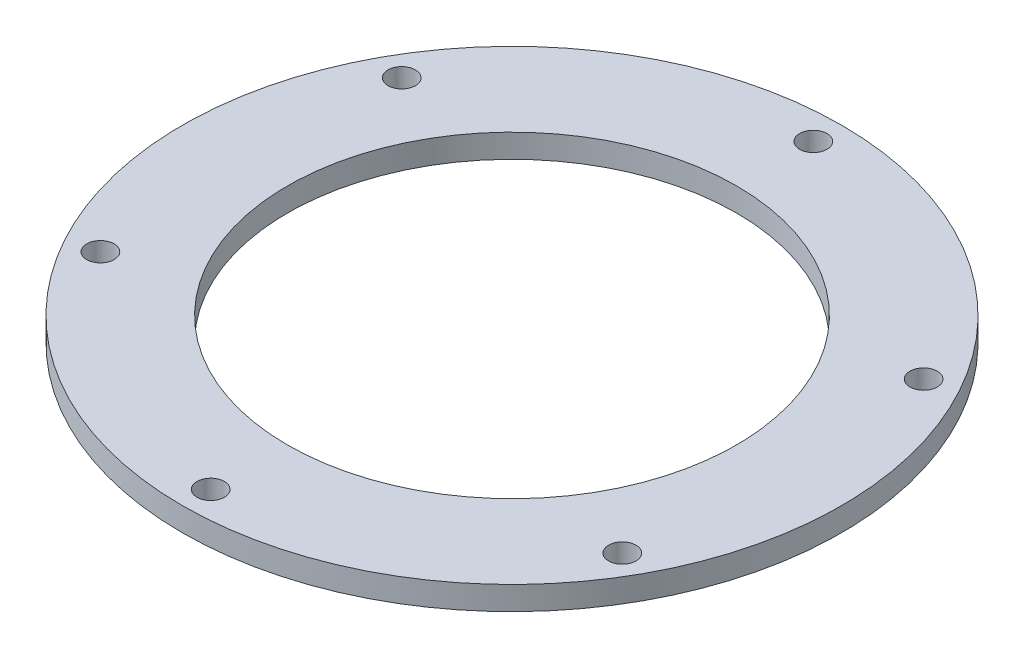
ISO-10303-21;
HEADER;
FILE_DESCRIPTION(('STEP AP214'),'2;1');
FILE_NAME('part.step','',(''),(''),'','','');
FILE_SCHEMA(('AUTOMOTIVE_DESIGN { 1 0 10303 214 1 1 1 1 }'));
ENDSEC;
DATA;
#1=APPLICATION_CONTEXT('core data for automotive mechanical design processes');
#2=APPLICATION_PROTOCOL_DEFINITION('international standard','automotive_design',2000,#1);
#3=PRODUCT_CONTEXT('',#1,'mechanical');
#4=PRODUCT('Part','Part','',(#3));
#5=PRODUCT_RELATED_PRODUCT_CATEGORY('part','',(#4));
#6=PRODUCT_DEFINITION_FORMATION('','',#4);
#7=PRODUCT_DEFINITION_CONTEXT('part definition',#1,'design');
#8=PRODUCT_DEFINITION('design','',#6,#7);
#9=PRODUCT_DEFINITION_SHAPE('','',#8);
#10=(LENGTH_UNIT() NAMED_UNIT(*) SI_UNIT(.MILLI.,.METRE.));
#11=(NAMED_UNIT(*) PLANE_ANGLE_UNIT() SI_UNIT($,.RADIAN.));
#12=(NAMED_UNIT(*) SI_UNIT($,.STERADIAN.) SOLID_ANGLE_UNIT());
#13=UNCERTAINTY_MEASURE_WITH_UNIT(LENGTH_MEASURE(1.E-05),#10,'distance_accuracy_value','');
#14=(GEOMETRIC_REPRESENTATION_CONTEXT(3) GLOBAL_UNCERTAINTY_ASSIGNED_CONTEXT((#13)) GLOBAL_UNIT_ASSIGNED_CONTEXT((#10,
#11,#12)) REPRESENTATION_CONTEXT('',''));
#15=CARTESIAN_POINT('',(0.,0.,0.));
#16=DIRECTION('',(0.,0.,1.));
#17=DIRECTION('',(1.,0.,0.));
#18=AXIS2_PLACEMENT_3D('',#15,#16,#17);
#19=CARTESIAN_POINT('',(0.,3.175,0.));
#20=DIRECTION('',(0.,1.,0.));
#21=DIRECTION('',(0.,0.,1.));
#22=AXIS2_PLACEMENT_3D('',#19,#20,#21);
#23=PLANE('',#22);
#24=CARTESIAN_POINT('',(35.1952724097994,3.175,-20.3200000000004));
#25=DIRECTION('',(0.,1.,0.));
#26=DIRECTION('',(0.,0.,1.));
#27=AXIS2_PLACEMENT_3D('',#24,#25,#26);
#28=CIRCLE('',#27,1.84785);
#29=CARTESIAN_POINT('',(35.1952724097994,3.175,-18.4721500000004));
#30=VERTEX_POINT('',#29);
#31=EDGE_CURVE('E84',#30,#30,#28,.T.);
#32=ORIENTED_EDGE('',*,*,#31,.F.);
#33=EDGE_LOOP('',(#32));
#34=FACE_BOUND('',#33,.T.);
#35=CARTESIAN_POINT('',(35.1952724097998,3.175,20.3199999999997));
#36=DIRECTION('',(0.,1.,0.));
#37=DIRECTION('',(0.,0.,1.));
#38=AXIS2_PLACEMENT_3D('',#35,#36,#37);
#39=CIRCLE('',#38,1.84785);
#40=CARTESIAN_POINT('',(35.1952724097998,3.175,22.1678499999997));
#41=VERTEX_POINT('',#40);
#42=EDGE_CURVE('E78',#41,#41,#39,.T.);
#43=ORIENTED_EDGE('',*,*,#42,.F.);
#44=EDGE_LOOP('',(#43));
#45=FACE_BOUND('',#44,.T.);
#46=CARTESIAN_POINT('',(0.,3.175,40.64));
#47=DIRECTION('',(0.,1.,0.));
#48=DIRECTION('',(0.,0.,1.));
#49=AXIS2_PLACEMENT_3D('',#46,#47,#48);
#50=CIRCLE('',#49,1.84785);
#51=CARTESIAN_POINT('',(0.,3.175,42.48785));
#52=VERTEX_POINT('',#51);
#53=EDGE_CURVE('E72',#52,#52,#50,.T.);
#54=ORIENTED_EDGE('',*,*,#53,.F.);
#55=EDGE_LOOP('',(#54));
#56=FACE_BOUND('',#55,.T.);
#57=CARTESIAN_POINT('',(-35.1952724097995,3.175,20.3200000000002));
#58=DIRECTION('',(0.,1.,0.));
#59=DIRECTION('',(0.,0.,1.));
#60=AXIS2_PLACEMENT_3D('',#57,#58,#59);
#61=CIRCLE('',#60,1.84785);
#62=CARTESIAN_POINT('',(-35.1952724097995,3.175,22.1678500000002));
#63=VERTEX_POINT('',#62);
#64=EDGE_CURVE('E66',#63,#63,#61,.T.);
#65=ORIENTED_EDGE('',*,*,#64,.F.);
#66=EDGE_LOOP('',(#65));
#67=FACE_BOUND('',#66,.T.);
#68=CARTESIAN_POINT('',(-35.1952724097996,3.175,-20.3199999999999));
#69=DIRECTION('',(0.,1.,0.));
#70=DIRECTION('',(0.,0.,1.));
#71=AXIS2_PLACEMENT_3D('',#68,#69,#70);
#72=CIRCLE('',#71,1.84785);
#73=CARTESIAN_POINT('',(-35.1952724097996,3.175,-18.4721499999999));
#74=VERTEX_POINT('',#73);
#75=EDGE_CURVE('E60',#74,#74,#72,.T.);
#76=ORIENTED_EDGE('',*,*,#75,.F.);
#77=EDGE_LOOP('',(#76));
#78=FACE_BOUND('',#77,.T.);
#79=CARTESIAN_POINT('',(0.,3.175,-40.64));
#80=DIRECTION('',(0.,1.,0.));
#81=DIRECTION('',(0.,0.,1.));
#82=AXIS2_PLACEMENT_3D('',#79,#80,#81);
#83=CIRCLE('',#82,1.84785);
#84=CARTESIAN_POINT('',(0.,3.175,-38.79215));
#85=VERTEX_POINT('',#84);
#86=EDGE_CURVE('E54',#85,#85,#83,.T.);
#87=ORIENTED_EDGE('',*,*,#86,.F.);
#88=EDGE_LOOP('',(#87));
#89=FACE_BOUND('',#88,.T.);
#90=CARTESIAN_POINT('',(0.,3.175,0.));
#91=DIRECTION('',(0.,1.,0.));
#92=DIRECTION('',(0.,0.,1.));
#93=AXIS2_PLACEMENT_3D('',#90,#91,#92);
#94=CIRCLE('',#93,44.45);
#95=CARTESIAN_POINT('',(0.,3.175,44.45));
#96=VERTEX_POINT('',#95);
#97=EDGE_CURVE('E10',#96,#96,#94,.T.);
#98=ORIENTED_EDGE('',*,*,#97,.T.);
#99=EDGE_LOOP('',(#98));
#100=FACE_BOUND('',#99,.T.);
#101=CARTESIAN_POINT('',(0.,3.175,0.));
#102=DIRECTION('',(0.,1.,0.));
#103=DIRECTION('',(0.,0.,1.));
#104=AXIS2_PLACEMENT_3D('',#101,#102,#103);
#105=CIRCLE('',#104,30.2759177092486);
#106=CARTESIAN_POINT('',(0.,3.175,30.2759177092486));
#107=VERTEX_POINT('',#106);
#108=EDGE_CURVE('E44',#107,#107,#105,.T.);
#109=ORIENTED_EDGE('',*,*,#108,.F.);
#110=EDGE_LOOP('',(#109));
#111=FACE_BOUND('',#110,.T.);
#112=ADVANCED_FACE('F33',(#34,#45,#56,#67,#78,#89,#100,#111),#23,.T.);
#113=CARTESIAN_POINT('',(0.,0.,0.));
#114=DIRECTION('',(0.,1.,0.));
#115=DIRECTION('',(0.,0.,1.));
#116=AXIS2_PLACEMENT_3D('',#113,#114,#115);
#117=PLANE('',#116);
#118=CARTESIAN_POINT('',(35.1952724097994,0.,-20.3200000000004));
#119=DIRECTION('',(0.,1.,0.));
#120=DIRECTION('',(0.,0.,1.));
#121=AXIS2_PLACEMENT_3D('',#118,#119,#120);
#122=CIRCLE('',#121,1.84785);
#123=CARTESIAN_POINT('',(35.1952724097994,0.,-18.4721500000004));
#124=VERTEX_POINT('',#123);
#125=EDGE_CURVE('E81',#124,#124,#122,.T.);
#126=ORIENTED_EDGE('',*,*,#125,.T.);
#127=EDGE_LOOP('',(#126));
#128=FACE_BOUND('',#127,.T.);
#129=CARTESIAN_POINT('',(35.1952724097998,0.,20.3199999999997));
#130=DIRECTION('',(0.,1.,0.));
#131=DIRECTION('',(0.,0.,1.));
#132=AXIS2_PLACEMENT_3D('',#129,#130,#131);
#133=CIRCLE('',#132,1.84785);
#134=CARTESIAN_POINT('',(35.1952724097998,0.,22.1678499999997));
#135=VERTEX_POINT('',#134);
#136=EDGE_CURVE('E75',#135,#135,#133,.T.);
#137=ORIENTED_EDGE('',*,*,#136,.T.);
#138=EDGE_LOOP('',(#137));
#139=FACE_BOUND('',#138,.T.);
#140=CARTESIAN_POINT('',(0.,0.,40.64));
#141=DIRECTION('',(0.,1.,0.));
#142=DIRECTION('',(0.,0.,1.));
#143=AXIS2_PLACEMENT_3D('',#140,#141,#142);
#144=CIRCLE('',#143,1.84785);
#145=CARTESIAN_POINT('',(0.,0.,42.48785));
#146=VERTEX_POINT('',#145);
#147=EDGE_CURVE('E69',#146,#146,#144,.T.);
#148=ORIENTED_EDGE('',*,*,#147,.T.);
#149=EDGE_LOOP('',(#148));
#150=FACE_BOUND('',#149,.T.);
#151=CARTESIAN_POINT('',(-35.1952724097995,0.,20.3200000000002));
#152=DIRECTION('',(0.,1.,0.));
#153=DIRECTION('',(0.,0.,1.));
#154=AXIS2_PLACEMENT_3D('',#151,#152,#153);
#155=CIRCLE('',#154,1.84785);
#156=CARTESIAN_POINT('',(-35.1952724097995,0.,22.1678500000002));
#157=VERTEX_POINT('',#156);
#158=EDGE_CURVE('E63',#157,#157,#155,.T.);
#159=ORIENTED_EDGE('',*,*,#158,.T.);
#160=EDGE_LOOP('',(#159));
#161=FACE_BOUND('',#160,.T.);
#162=CARTESIAN_POINT('',(-35.1952724097996,0.,-20.3199999999999));
#163=DIRECTION('',(0.,1.,0.));
#164=DIRECTION('',(0.,0.,1.));
#165=AXIS2_PLACEMENT_3D('',#162,#163,#164);
#166=CIRCLE('',#165,1.84785);
#167=CARTESIAN_POINT('',(-35.1952724097996,0.,-18.4721499999999));
#168=VERTEX_POINT('',#167);
#169=EDGE_CURVE('E57',#168,#168,#166,.T.);
#170=ORIENTED_EDGE('',*,*,#169,.T.);
#171=EDGE_LOOP('',(#170));
#172=FACE_BOUND('',#171,.T.);
#173=CARTESIAN_POINT('',(0.,0.,-40.64));
#174=DIRECTION('',(0.,1.,0.));
#175=DIRECTION('',(0.,0.,1.));
#176=AXIS2_PLACEMENT_3D('',#173,#174,#175);
#177=CIRCLE('',#176,1.84785);
#178=CARTESIAN_POINT('',(0.,0.,-38.79215));
#179=VERTEX_POINT('',#178);
#180=EDGE_CURVE('E49',#179,#179,#177,.T.);
#181=ORIENTED_EDGE('',*,*,#180,.T.);
#182=EDGE_LOOP('',(#181));
#183=FACE_BOUND('',#182,.T.);
#184=CARTESIAN_POINT('',(0.,0.,0.));
#185=DIRECTION('',(0.,1.,0.));
#186=DIRECTION('',(0.,0.,1.));
#187=AXIS2_PLACEMENT_3D('',#184,#185,#186);
#188=CIRCLE('',#187,44.45);
#189=CARTESIAN_POINT('',(0.,0.,44.45));
#190=VERTEX_POINT('',#189);
#191=EDGE_CURVE('E37',#190,#190,#188,.T.);
#192=ORIENTED_EDGE('',*,*,#191,.F.);
#193=EDGE_LOOP('',(#192));
#194=FACE_BOUND('',#193,.T.);
#195=CARTESIAN_POINT('',(0.,0.,0.));
#196=DIRECTION('',(0.,1.,0.));
#197=DIRECTION('',(0.,0.,1.));
#198=AXIS2_PLACEMENT_3D('',#195,#196,#197);
#199=CIRCLE('',#198,30.2759177092486);
#200=CARTESIAN_POINT('',(0.,0.,30.2759177092486));
#201=VERTEX_POINT('',#200);
#202=EDGE_CURVE('E46',#201,#201,#199,.T.);
#203=ORIENTED_EDGE('',*,*,#202,.T.);
#204=EDGE_LOOP('',(#203));
#205=FACE_BOUND('',#204,.T.);
#206=ADVANCED_FACE('F92',(#128,#139,#150,#161,#172,#183,#194,#205),#117,.F.);
#207=CARTESIAN_POINT('',(0.,3.175,0.));
#208=DIRECTION('',(0.,-1.,0.));
#209=DIRECTION('',(0.,0.,-1.));
#210=AXIS2_PLACEMENT_3D('',#207,#208,#209);
#211=CYLINDRICAL_SURFACE('',#210,44.45);
#212=ORIENTED_EDGE('',*,*,#97,.F.);
#213=EDGE_LOOP('',(#212));
#214=FACE_BOUND('',#213,.T.);
#215=ORIENTED_EDGE('',*,*,#191,.T.);
#216=EDGE_LOOP('',(#215));
#217=FACE_BOUND('',#216,.T.);
#218=ADVANCED_FACE('F35',(#214,#217),#211,.T.);
#219=CARTESIAN_POINT('',(0.,3.175,0.));
#220=DIRECTION('',(0.,-1.,0.));
#221=DIRECTION('',(0.,0.,-1.));
#222=AXIS2_PLACEMENT_3D('',#219,#220,#221);
#223=CYLINDRICAL_SURFACE('',#222,30.2759177092486);
#224=ORIENTED_EDGE('',*,*,#108,.T.);
#225=EDGE_LOOP('',(#224));
#226=FACE_BOUND('',#225,.T.);
#227=ORIENTED_EDGE('',*,*,#202,.F.);
#228=EDGE_LOOP('',(#227));
#229=FACE_BOUND('',#228,.T.);
#230=ADVANCED_FACE('F106',(#226,#229),#223,.F.);
#231=CARTESIAN_POINT('',(0.,3.175,-40.64));
#232=DIRECTION('',(0.,1.,0.));
#233=DIRECTION('',(0.,0.,1.));
#234=AXIS2_PLACEMENT_3D('',#231,#232,#233);
#235=CYLINDRICAL_SURFACE('',#234,1.84785);
#236=ORIENTED_EDGE('',*,*,#180,.F.);
#237=EDGE_LOOP('',(#236));
#238=FACE_BOUND('',#237,.T.);
#239=ORIENTED_EDGE('',*,*,#86,.T.);
#240=EDGE_LOOP('',(#239));
#241=FACE_BOUND('',#240,.T.);
#242=ADVANCED_FACE('F109',(#238,#241),#235,.F.);
#243=CARTESIAN_POINT('',(-35.1952724097996,3.175,-20.3199999999999));
#244=DIRECTION('',(0.,1.,0.));
#245=DIRECTION('',(0.,0.,1.));
#246=AXIS2_PLACEMENT_3D('',#243,#244,#245);
#247=CYLINDRICAL_SURFACE('',#246,1.84785);
#248=ORIENTED_EDGE('',*,*,#169,.F.);
#249=EDGE_LOOP('',(#248));
#250=FACE_BOUND('',#249,.T.);
#251=ORIENTED_EDGE('',*,*,#75,.T.);
#252=EDGE_LOOP('',(#251));
#253=FACE_BOUND('',#252,.T.);
#254=ADVANCED_FACE('F123',(#250,#253),#247,.F.);
#255=CARTESIAN_POINT('',(-35.1952724097995,3.175,20.3200000000002));
#256=DIRECTION('',(0.,1.,0.));
#257=DIRECTION('',(0.,0.,1.));
#258=AXIS2_PLACEMENT_3D('',#255,#256,#257);
#259=CYLINDRICAL_SURFACE('',#258,1.84785);
#260=ORIENTED_EDGE('',*,*,#158,.F.);
#261=EDGE_LOOP('',(#260));
#262=FACE_BOUND('',#261,.T.);
#263=ORIENTED_EDGE('',*,*,#64,.T.);
#264=EDGE_LOOP('',(#263));
#265=FACE_BOUND('',#264,.T.);
#266=ADVANCED_FACE('F127',(#262,#265),#259,.F.);
#267=CARTESIAN_POINT('',(0.,3.175,40.64));
#268=DIRECTION('',(0.,1.,0.));
#269=DIRECTION('',(0.,0.,1.));
#270=AXIS2_PLACEMENT_3D('',#267,#268,#269);
#271=CYLINDRICAL_SURFACE('',#270,1.84785);
#272=ORIENTED_EDGE('',*,*,#147,.F.);
#273=EDGE_LOOP('',(#272));
#274=FACE_BOUND('',#273,.T.);
#275=ORIENTED_EDGE('',*,*,#53,.T.);
#276=EDGE_LOOP('',(#275));
#277=FACE_BOUND('',#276,.T.);
#278=ADVANCED_FACE('F131',(#274,#277),#271,.F.);
#279=CARTESIAN_POINT('',(35.1952724097998,3.175,20.3199999999997));
#280=DIRECTION('',(0.,1.,0.));
#281=DIRECTION('',(0.,0.,1.));
#282=AXIS2_PLACEMENT_3D('',#279,#280,#281);
#283=CYLINDRICAL_SURFACE('',#282,1.84785);
#284=ORIENTED_EDGE('',*,*,#136,.F.);
#285=EDGE_LOOP('',(#284));
#286=FACE_BOUND('',#285,.T.);
#287=ORIENTED_EDGE('',*,*,#42,.T.);
#288=EDGE_LOOP('',(#287));
#289=FACE_BOUND('',#288,.T.);
#290=ADVANCED_FACE('F135',(#286,#289),#283,.F.);
#291=CARTESIAN_POINT('',(35.1952724097994,3.175,-20.3200000000004));
#292=DIRECTION('',(0.,1.,0.));
#293=DIRECTION('',(0.,0.,1.));
#294=AXIS2_PLACEMENT_3D('',#291,#292,#293);
#295=CYLINDRICAL_SURFACE('',#294,1.84785);
#296=ORIENTED_EDGE('',*,*,#125,.F.);
#297=EDGE_LOOP('',(#296));
#298=FACE_BOUND('',#297,.T.);
#299=ORIENTED_EDGE('',*,*,#31,.T.);
#300=EDGE_LOOP('',(#299));
#301=FACE_BOUND('',#300,.T.);
#302=ADVANCED_FACE('F88',(#298,#301),#295,.F.);
#303=CLOSED_SHELL('',(#112,#206,#218,#230,#242,#254,#266,#278,#290,#302));
#304=MANIFOLD_SOLID_BREP('B2',#303);
#305=ADVANCED_BREP_SHAPE_REPRESENTATION('',(#18,#304),#14);
#306=SHAPE_DEFINITION_REPRESENTATION(#9,#305);
ENDSEC;
END-ISO-10303-21;
